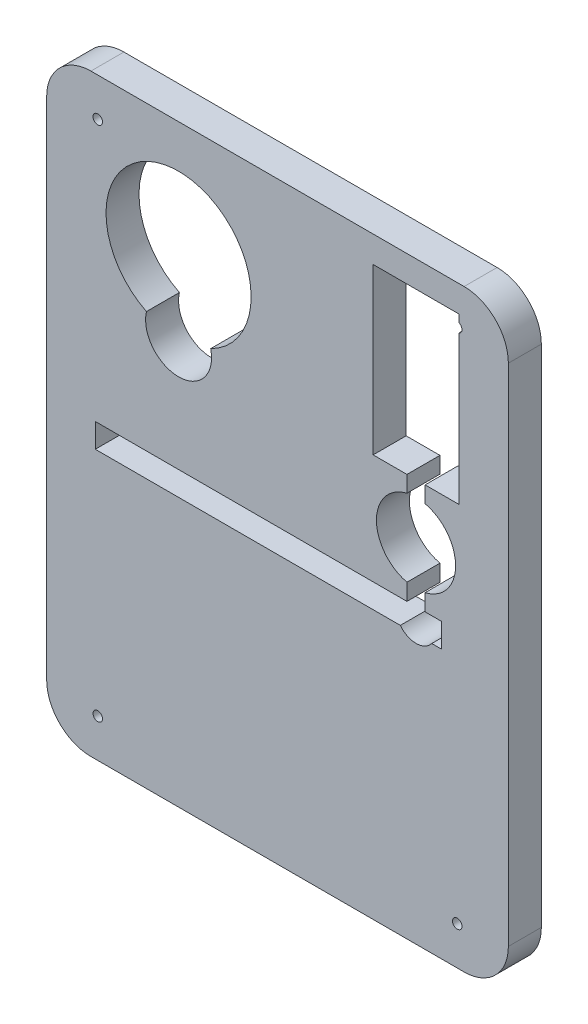
ISO-10303-21;
HEADER;
FILE_DESCRIPTION(('STEP AP214'),'2;1');
FILE_NAME('part.step','',(''),(''),'','','');
FILE_SCHEMA(('AUTOMOTIVE_DESIGN { 1 0 10303 214 1 1 1 1 }'));
ENDSEC;
DATA;
#1=APPLICATION_CONTEXT('core data for automotive mechanical design processes');
#2=APPLICATION_PROTOCOL_DEFINITION('international standard','automotive_design',2000,#1);
#3=PRODUCT_CONTEXT('',#1,'mechanical');
#4=PRODUCT('Part','Part','',(#3));
#5=PRODUCT_RELATED_PRODUCT_CATEGORY('part','',(#4));
#6=PRODUCT_DEFINITION_FORMATION('','',#4);
#7=PRODUCT_DEFINITION_CONTEXT('part definition',#1,'design');
#8=PRODUCT_DEFINITION('design','',#6,#7);
#9=PRODUCT_DEFINITION_SHAPE('','',#8);
#10=(LENGTH_UNIT() NAMED_UNIT(*) SI_UNIT(.MILLI.,.METRE.));
#11=(NAMED_UNIT(*) PLANE_ANGLE_UNIT() SI_UNIT($,.RADIAN.));
#12=(NAMED_UNIT(*) SI_UNIT($,.STERADIAN.) SOLID_ANGLE_UNIT());
#13=UNCERTAINTY_MEASURE_WITH_UNIT(LENGTH_MEASURE(1.E-05),#10,'distance_accuracy_value','');
#14=(GEOMETRIC_REPRESENTATION_CONTEXT(3) GLOBAL_UNCERTAINTY_ASSIGNED_CONTEXT((#13)) GLOBAL_UNIT_ASSIGNED_CONTEXT((#10,
#11,#12)) REPRESENTATION_CONTEXT('',''));
#15=CARTESIAN_POINT('',(0.,0.,0.));
#16=DIRECTION('',(0.,0.,1.));
#17=DIRECTION('',(1.,0.,0.));
#18=AXIS2_PLACEMENT_3D('',#15,#16,#17);
#19=CARTESIAN_POINT('',(69.85,104.14,0.));
#20=DIRECTION('',(1.,0.,0.));
#21=DIRECTION('',(0.,1.,0.));
#22=AXIS2_PLACEMENT_3D('',#19,#20,#21);
#23=PLANE('',#22);
#24=DIRECTION('',(0.,1.,0.));
#25=VECTOR('',#24,1.);
#26=CARTESIAN_POINT('',(69.85,104.14,0.));
#27=LINE('',#26,#25);
#28=CARTESIAN_POINT('',(69.85,101.22515584807,0.));
#29=VERTEX_POINT('',#28);
#30=CARTESIAN_POINT('',(69.85,104.14,0.));
#31=VERTEX_POINT('',#30);
#32=EDGE_CURVE('E246',#29,#31,#27,.T.);
#33=ORIENTED_EDGE('',*,*,#32,.F.);
#34=DIRECTION('',(0.,0.,1.));
#35=VECTOR('',#34,1.);
#36=CARTESIAN_POINT('',(69.85,101.22515584807,12.7));
#37=LINE('',#36,#35);
#38=CARTESIAN_POINT('',(69.85,101.22515584807,12.7));
#39=VERTEX_POINT('',#38);
#40=EDGE_CURVE('E11',#29,#39,#37,.T.);
#41=ORIENTED_EDGE('',*,*,#40,.T.);
#42=DIRECTION('',(0.,1.,0.));
#43=VECTOR('',#42,1.);
#44=CARTESIAN_POINT('',(69.85,104.14,12.7));
#45=LINE('',#44,#43);
#46=CARTESIAN_POINT('',(69.85,104.14,12.7));
#47=VERTEX_POINT('',#46);
#48=EDGE_CURVE('E312',#39,#47,#45,.T.);
#49=ORIENTED_EDGE('',*,*,#48,.T.);
#50=DIRECTION('',(0.,0.,1.));
#51=VECTOR('',#50,1.);
#52=CARTESIAN_POINT('',(69.85,104.14,0.));
#53=LINE('',#52,#51);
#54=EDGE_CURVE('E254',#31,#47,#53,.T.);
#55=ORIENTED_EDGE('',*,*,#54,.F.);
#56=EDGE_LOOP('',(#33,#41,#49,#55));
#57=FACE_BOUND('',#56,.T.);
#58=ADVANCED_FACE('F41',(#57),#23,.F.);
#59=CARTESIAN_POINT('',(-71.8566,-97.2566,12.7));
#60=DIRECTION('',(0.,0.,-1.));
#61=DIRECTION('',(-1.,0.,0.));
#62=AXIS2_PLACEMENT_3D('',#59,#60,#61);
#63=CYLINDRICAL_SURFACE('',#62,17.0434);
#64=CARTESIAN_POINT('',(-71.8566,-97.2566,0.));
#65=DIRECTION('',(0.,0.,1.));
#66=DIRECTION('',(-1.,0.,0.));
#67=AXIS2_PLACEMENT_3D('',#64,#65,#66);
#68=CIRCLE('',#67,17.0434);
#69=CARTESIAN_POINT('',(-88.9,-97.2566,0.));
#70=VERTEX_POINT('',#69);
#71=CARTESIAN_POINT('',(-71.8566,-114.3,0.));
#72=VERTEX_POINT('',#71);
#73=EDGE_CURVE('E322',#70,#72,#68,.T.);
#74=ORIENTED_EDGE('',*,*,#73,.T.);
#75=DIRECTION('',(0.,0.,-1.));
#76=VECTOR('',#75,1.);
#77=CARTESIAN_POINT('',(-71.8566,-114.3,12.7));
#78=LINE('',#77,#76);
#79=CARTESIAN_POINT('',(-71.8566,-114.3,12.7));
#80=VERTEX_POINT('',#79);
#81=EDGE_CURVE('E410',#80,#72,#78,.T.);
#82=ORIENTED_EDGE('',*,*,#81,.F.);
#83=CARTESIAN_POINT('',(-71.8566,-97.2566,12.7));
#84=DIRECTION('',(0.,0.,1.));
#85=DIRECTION('',(-1.,0.,0.));
#86=AXIS2_PLACEMENT_3D('',#83,#84,#85);
#87=CIRCLE('',#86,17.0434);
#88=CARTESIAN_POINT('',(-88.9,-97.2566,12.7));
#89=VERTEX_POINT('',#88);
#90=EDGE_CURVE('E356',#89,#80,#87,.T.);
#91=ORIENTED_EDGE('',*,*,#90,.F.);
#92=DIRECTION('',(0.,0.,-1.));
#93=VECTOR('',#92,1.);
#94=CARTESIAN_POINT('',(-88.9,-97.2566,12.7));
#95=LINE('',#94,#93);
#96=EDGE_CURVE('E374',#89,#70,#95,.T.);
#97=ORIENTED_EDGE('',*,*,#96,.T.);
#98=EDGE_LOOP('',(#74,#82,#91,#97));
#99=FACE_BOUND('',#98,.T.);
#100=ADVANCED_FACE('F43',(#99),#63,.T.);
#101=CARTESIAN_POINT('',(71.8566,-114.3,12.7));
#102=DIRECTION('',(0.,1.,0.));
#103=DIRECTION('',(0.,0.,1.));
#104=AXIS2_PLACEMENT_3D('',#101,#102,#103);
#105=PLANE('',#104);
#106=DIRECTION('',(1.,0.,0.));
#107=VECTOR('',#106,1.);
#108=CARTESIAN_POINT('',(71.8566,-114.3,0.));
#109=LINE('',#108,#107);
#110=CARTESIAN_POINT('',(71.8566,-114.3,0.));
#111=VERTEX_POINT('',#110);
#112=EDGE_CURVE('E377',#72,#111,#109,.T.);
#113=ORIENTED_EDGE('',*,*,#112,.T.);
#114=DIRECTION('',(0.,0.,-1.));
#115=VECTOR('',#114,1.);
#116=CARTESIAN_POINT('',(71.8566,-114.3,12.7));
#117=LINE('',#116,#115);
#118=CARTESIAN_POINT('',(71.8566,-114.3,12.7));
#119=VERTEX_POINT('',#118);
#120=EDGE_CURVE('E407',#119,#111,#117,.T.);
#121=ORIENTED_EDGE('',*,*,#120,.F.);
#122=DIRECTION('',(1.,0.,0.));
#123=VECTOR('',#122,1.);
#124=CARTESIAN_POINT('',(71.8566,-114.3,12.7));
#125=LINE('',#124,#123);
#126=EDGE_CURVE('E359',#80,#119,#125,.T.);
#127=ORIENTED_EDGE('',*,*,#126,.F.);
#128=ORIENTED_EDGE('',*,*,#81,.T.);
#129=EDGE_LOOP('',(#113,#121,#127,#128));
#130=FACE_BOUND('',#129,.T.);
#131=ADVANCED_FACE('F568',(#130),#105,.F.);
#132=CARTESIAN_POINT('',(71.8566,-97.2566,12.7));
#133=DIRECTION('',(0.,0.,-1.));
#134=DIRECTION('',(-1.,0.,0.));
#135=AXIS2_PLACEMENT_3D('',#132,#133,#134);
#136=CYLINDRICAL_SURFACE('',#135,17.0434);
#137=CARTESIAN_POINT('',(71.8566,-97.2566,0.));
#138=DIRECTION('',(0.,0.,1.));
#139=DIRECTION('',(-1.,0.,0.));
#140=AXIS2_PLACEMENT_3D('',#137,#138,#139);
#141=CIRCLE('',#140,17.0434);
#142=CARTESIAN_POINT('',(88.9,-97.2566,0.));
#143=VERTEX_POINT('',#142);
#144=EDGE_CURVE('E379',#111,#143,#141,.T.);
#145=ORIENTED_EDGE('',*,*,#144,.T.);
#146=DIRECTION('',(0.,0.,-1.));
#147=VECTOR('',#146,1.);
#148=CARTESIAN_POINT('',(88.9,-97.2566,12.7));
#149=LINE('',#148,#147);
#150=CARTESIAN_POINT('',(88.9,-97.2566,12.7));
#151=VERTEX_POINT('',#150);
#152=EDGE_CURVE('E404',#151,#143,#149,.T.);
#153=ORIENTED_EDGE('',*,*,#152,.F.);
#154=CARTESIAN_POINT('',(71.8566,-97.2566,12.7));
#155=DIRECTION('',(0.,0.,1.));
#156=DIRECTION('',(-1.,0.,0.));
#157=AXIS2_PLACEMENT_3D('',#154,#155,#156);
#158=CIRCLE('',#157,17.0434);
#159=EDGE_CURVE('E362',#119,#151,#158,.T.);
#160=ORIENTED_EDGE('',*,*,#159,.F.);
#161=ORIENTED_EDGE('',*,*,#120,.T.);
#162=EDGE_LOOP('',(#145,#153,#160,#161));
#163=FACE_BOUND('',#162,.T.);
#164=ADVANCED_FACE('F625',(#163),#136,.T.);
#165=CARTESIAN_POINT('',(88.9,-97.2566,12.7));
#166=DIRECTION('',(-1.,0.,0.));
#167=DIRECTION('',(0.,0.,1.));
#168=AXIS2_PLACEMENT_3D('',#165,#166,#167);
#169=PLANE('',#168);
#170=DIRECTION('',(0.,1.,0.));
#171=VECTOR('',#170,1.);
#172=CARTESIAN_POINT('',(88.9,-97.2566,0.));
#173=LINE('',#172,#171);
#174=CARTESIAN_POINT('',(88.9,97.2566,0.));
#175=VERTEX_POINT('',#174);
#176=EDGE_CURVE('E381',#143,#175,#173,.T.);
#177=ORIENTED_EDGE('',*,*,#176,.T.);
#178=DIRECTION('',(0.,0.,-1.));
#179=VECTOR('',#178,1.);
#180=CARTESIAN_POINT('',(88.9,97.2566,12.7));
#181=LINE('',#180,#179);
#182=CARTESIAN_POINT('',(88.9,97.2566,12.7));
#183=VERTEX_POINT('',#182);
#184=EDGE_CURVE('E401',#183,#175,#181,.T.);
#185=ORIENTED_EDGE('',*,*,#184,.F.);
#186=DIRECTION('',(0.,1.,0.));
#187=VECTOR('',#186,1.);
#188=CARTESIAN_POINT('',(88.9,-97.2566,12.7));
#189=LINE('',#188,#187);
#190=EDGE_CURVE('E364',#151,#183,#189,.T.);
#191=ORIENTED_EDGE('',*,*,#190,.F.);
#192=ORIENTED_EDGE('',*,*,#152,.T.);
#193=EDGE_LOOP('',(#177,#185,#191,#192));
#194=FACE_BOUND('',#193,.T.);
#195=ADVANCED_FACE('F621',(#194),#169,.F.);
#196=CARTESIAN_POINT('',(71.8566,97.2566,12.7));
#197=DIRECTION('',(0.,0.,-1.));
#198=DIRECTION('',(-1.,0.,0.));
#199=AXIS2_PLACEMENT_3D('',#196,#197,#198);
#200=CYLINDRICAL_SURFACE('',#199,17.0434);
#201=CARTESIAN_POINT('',(71.8566,97.2566,0.));
#202=DIRECTION('',(0.,0.,1.));
#203=DIRECTION('',(1.,0.,0.));
#204=AXIS2_PLACEMENT_3D('',#201,#202,#203);
#205=CIRCLE('',#204,17.0434);
#206=CARTESIAN_POINT('',(71.8566,114.3,0.));
#207=VERTEX_POINT('',#206);
#208=EDGE_CURVE('E383',#175,#207,#205,.T.);
#209=ORIENTED_EDGE('',*,*,#208,.T.);
#210=DIRECTION('',(0.,0.,-1.));
#211=VECTOR('',#210,1.);
#212=CARTESIAN_POINT('',(71.8566,114.3,12.7));
#213=LINE('',#212,#211);
#214=CARTESIAN_POINT('',(71.8566,114.3,12.7));
#215=VERTEX_POINT('',#214);
#216=EDGE_CURVE('E398',#215,#207,#213,.T.);
#217=ORIENTED_EDGE('',*,*,#216,.F.);
#218=CARTESIAN_POINT('',(71.8566,97.2566,12.7));
#219=DIRECTION('',(0.,0.,1.));
#220=DIRECTION('',(1.,0.,0.));
#221=AXIS2_PLACEMENT_3D('',#218,#219,#220);
#222=CIRCLE('',#221,17.0434);
#223=EDGE_CURVE('E366',#183,#215,#222,.T.);
#224=ORIENTED_EDGE('',*,*,#223,.F.);
#225=ORIENTED_EDGE('',*,*,#184,.T.);
#226=EDGE_LOOP('',(#209,#217,#224,#225));
#227=FACE_BOUND('',#226,.T.);
#228=ADVANCED_FACE('F617',(#227),#200,.T.);
#229=CARTESIAN_POINT('',(71.8566,114.3,12.7));
#230=DIRECTION('',(0.,-1.,0.));
#231=DIRECTION('',(0.,0.,-1.));
#232=AXIS2_PLACEMENT_3D('',#229,#230,#231);
#233=PLANE('',#232);
#234=DIRECTION('',(-1.,0.,0.));
#235=VECTOR('',#234,1.);
#236=CARTESIAN_POINT('',(71.8566,114.3,0.));
#237=LINE('',#236,#235);
#238=CARTESIAN_POINT('',(-71.8566,114.3,0.));
#239=VERTEX_POINT('',#238);
#240=EDGE_CURVE('E385',#207,#239,#237,.T.);
#241=ORIENTED_EDGE('',*,*,#240,.T.);
#242=DIRECTION('',(0.,0.,-1.));
#243=VECTOR('',#242,1.);
#244=CARTESIAN_POINT('',(-71.8566,114.3,12.7));
#245=LINE('',#244,#243);
#246=CARTESIAN_POINT('',(-71.8566,114.3,12.7));
#247=VERTEX_POINT('',#246);
#248=EDGE_CURVE('E395',#247,#239,#245,.T.);
#249=ORIENTED_EDGE('',*,*,#248,.F.);
#250=DIRECTION('',(-1.,0.,0.));
#251=VECTOR('',#250,1.);
#252=CARTESIAN_POINT('',(71.8566,114.3,12.7));
#253=LINE('',#252,#251);
#254=EDGE_CURVE('E368',#215,#247,#253,.T.);
#255=ORIENTED_EDGE('',*,*,#254,.F.);
#256=ORIENTED_EDGE('',*,*,#216,.T.);
#257=EDGE_LOOP('',(#241,#249,#255,#256));
#258=FACE_BOUND('',#257,.T.);
#259=ADVANCED_FACE('F613',(#258),#233,.F.);
#260=CARTESIAN_POINT('',(-71.8566,97.2566,12.7));
#261=DIRECTION('',(0.,0.,-1.));
#262=DIRECTION('',(-1.,0.,0.));
#263=AXIS2_PLACEMENT_3D('',#260,#261,#262);
#264=CYLINDRICAL_SURFACE('',#263,17.0434);
#265=CARTESIAN_POINT('',(-71.8566,97.2566,0.));
#266=DIRECTION('',(0.,0.,1.));
#267=DIRECTION('',(-1.,0.,0.));
#268=AXIS2_PLACEMENT_3D('',#265,#266,#267);
#269=CIRCLE('',#268,17.0434);
#270=CARTESIAN_POINT('',(-88.9,97.2566,0.));
#271=VERTEX_POINT('',#270);
#272=EDGE_CURVE('E387',#239,#271,#269,.T.);
#273=ORIENTED_EDGE('',*,*,#272,.T.);
#274=DIRECTION('',(0.,0.,-1.));
#275=VECTOR('',#274,1.);
#276=CARTESIAN_POINT('',(-88.9,97.2566,12.7));
#277=LINE('',#276,#275);
#278=CARTESIAN_POINT('',(-88.9,97.2566,12.7));
#279=VERTEX_POINT('',#278);
#280=EDGE_CURVE('E392',#279,#271,#277,.T.);
#281=ORIENTED_EDGE('',*,*,#280,.F.);
#282=CARTESIAN_POINT('',(-71.8566,97.2566,12.7));
#283=DIRECTION('',(0.,0.,1.));
#284=DIRECTION('',(-1.,0.,0.));
#285=AXIS2_PLACEMENT_3D('',#282,#283,#284);
#286=CIRCLE('',#285,17.0434);
#287=EDGE_CURVE('E370',#247,#279,#286,.T.);
#288=ORIENTED_EDGE('',*,*,#287,.F.);
#289=ORIENTED_EDGE('',*,*,#248,.T.);
#290=EDGE_LOOP('',(#273,#281,#288,#289));
#291=FACE_BOUND('',#290,.T.);
#292=ADVANCED_FACE('F609',(#291),#264,.T.);
#293=CARTESIAN_POINT('',(-88.9,-97.2566,12.7));
#294=DIRECTION('',(1.,0.,0.));
#295=DIRECTION('',(0.,0.,-1.));
#296=AXIS2_PLACEMENT_3D('',#293,#294,#295);
#297=PLANE('',#296);
#298=DIRECTION('',(0.,-1.,0.));
#299=VECTOR('',#298,1.);
#300=CARTESIAN_POINT('',(-88.9,-97.2566,0.));
#301=LINE('',#300,#299);
#302=EDGE_CURVE('E360',#271,#70,#301,.T.);
#303=ORIENTED_EDGE('',*,*,#302,.T.);
#304=ORIENTED_EDGE('',*,*,#96,.F.);
#305=DIRECTION('',(0.,-1.,0.));
#306=VECTOR('',#305,1.);
#307=CARTESIAN_POINT('',(-88.9,-97.2566,12.7));
#308=LINE('',#307,#306);
#309=EDGE_CURVE('E372',#279,#89,#308,.T.);
#310=ORIENTED_EDGE('',*,*,#309,.F.);
#311=ORIENTED_EDGE('',*,*,#280,.T.);
#312=EDGE_LOOP('',(#303,#304,#310,#311));
#313=FACE_BOUND('',#312,.T.);
#314=ADVANCED_FACE('F602',(#313),#297,.F.);
#315=CARTESIAN_POINT('',(-71.8566,-97.2566,12.7));
#316=DIRECTION('',(0.,0.,-1.));
#317=DIRECTION('',(-1.,0.,0.));
#318=AXIS2_PLACEMENT_3D('',#315,#316,#317);
#319=PLANE('',#318);
#320=CARTESIAN_POINT('',(-69.21913,-99.508615,12.7));
#321=DIRECTION('',(0.,0.,1.));
#322=DIRECTION('',(1.,0.,0.));
#323=AXIS2_PLACEMENT_3D('',#320,#321,#322);
#324=CIRCLE('',#323,1.82879999999999);
#325=CARTESIAN_POINT('',(-67.39033,-99.508615,12.7));
#326=VERTEX_POINT('',#325);
#327=EDGE_CURVE('E866',#326,#326,#324,.T.);
#328=ORIENTED_EDGE('',*,*,#327,.F.);
#329=EDGE_LOOP('',(#328));
#330=FACE_BOUND('',#329,.T.);
#331=CARTESIAN_POINT('',(69.219129999995,-99.5086149999996,12.7));
#332=DIRECTION('',(0.,0.,1.));
#333=DIRECTION('',(1.,0.,0.));
#334=AXIS2_PLACEMENT_3D('',#331,#332,#333);
#335=CIRCLE('',#334,1.82879999999999);
#336=CARTESIAN_POINT('',(71.047929999995,-99.5086149999996,12.7));
#337=VERTEX_POINT('',#336);
#338=EDGE_CURVE('E423',#337,#337,#335,.T.);
#339=ORIENTED_EDGE('',*,*,#338,.F.);
#340=EDGE_LOOP('',(#339));
#341=FACE_BOUND('',#340,.T.);
#342=CARTESIAN_POINT('',(-69.219129999995,99.5086149999996,12.7));
#343=DIRECTION('',(0.,0.,1.));
#344=DIRECTION('',(1.,0.,0.));
#345=AXIS2_PLACEMENT_3D('',#342,#343,#344);
#346=CIRCLE('',#345,1.82879999999999);
#347=CARTESIAN_POINT('',(-67.390329999995,99.5086149999996,12.7));
#348=VERTEX_POINT('',#347);
#349=EDGE_CURVE('E251',#348,#348,#346,.T.);
#350=ORIENTED_EDGE('',*,*,#349,.F.);
#351=EDGE_LOOP('',(#350));
#352=FACE_BOUND('',#351,.T.);
#353=CARTESIAN_POINT('',(-38.1,69.85,12.7));
#354=DIRECTION('',(0.,0.,1.));
#355=DIRECTION('',(1.,0.,0.));
#356=AXIS2_PLACEMENT_3D('',#353,#354,#355);
#357=CIRCLE('',#356,27.94);
#358=CARTESIAN_POINT('',(-25.7323444032962,44.7963636363636,12.7));
#359=VERTEX_POINT('',#358);
#360=CARTESIAN_POINT('',(-50.4676555967038,44.7963636363636,12.7));
#361=VERTEX_POINT('',#360);
#362=EDGE_CURVE('E437',#359,#361,#357,.T.);
#363=ORIENTED_EDGE('',*,*,#362,.F.);
#364=CARTESIAN_POINT('',(-38.1,41.91,12.7));
#365=DIRECTION('',(0.,0.,1.));
#366=DIRECTION('',(1.,0.,0.));
#367=AXIS2_PLACEMENT_3D('',#364,#365,#366);
#368=CIRCLE('',#367,12.7);
#369=EDGE_CURVE('E64',#361,#359,#368,.T.);
#370=ORIENTED_EDGE('',*,*,#369,.F.);
#371=EDGE_LOOP('',(#363,#370));
#372=FACE_BOUND('',#371,.T.);
#373=ORIENTED_EDGE('',*,*,#48,.F.);
#374=CARTESIAN_POINT('',(69.219129999995,99.5086149999996,12.7));
#375=DIRECTION('',(0.,0.,1.));
#376=DIRECTION('',(1.,0.,0.));
#377=AXIS2_PLACEMENT_3D('',#374,#375,#376);
#378=CIRCLE('',#377,1.82879999999999);
#379=CARTESIAN_POINT('',(69.85,97.7920741519294,12.7));
#380=VERTEX_POINT('',#379);
#381=EDGE_CURVE('E237',#380,#39,#378,.T.);
#382=ORIENTED_EDGE('',*,*,#381,.F.);
#383=CARTESIAN_POINT('',(69.85,40.64,12.7));
#384=VERTEX_POINT('',#383);
#385=EDGE_CURVE('E313',#384,#380,#45,.T.);
#386=ORIENTED_EDGE('',*,*,#385,.F.);
#387=DIRECTION('',(1.,0.,0.));
#388=VECTOR('',#387,1.);
#389=CARTESIAN_POINT('',(56.8325,40.64,12.7));
#390=LINE('',#389,#388);
#391=CARTESIAN_POINT('',(56.8325,40.64,12.7));
#392=VERTEX_POINT('',#391);
#393=EDGE_CURVE('E309',#392,#384,#390,.T.);
#394=ORIENTED_EDGE('',*,*,#393,.F.);
#395=DIRECTION('',(0.,1.,0.));
#396=VECTOR('',#395,1.);
#397=CARTESIAN_POINT('',(56.8325,40.64,12.7));
#398=LINE('',#397,#396);
#399=CARTESIAN_POINT('',(56.8325,34.360670910504,12.7));
#400=VERTEX_POINT('',#399);
#401=EDGE_CURVE('E306',#400,#392,#398,.T.);
#402=ORIENTED_EDGE('',*,*,#401,.F.);
#403=CARTESIAN_POINT('',(53.34,19.52625,12.7));
#404=DIRECTION('',(0.,0.,1.));
#405=DIRECTION('',(1.,0.,0.));
#406=AXIS2_PLACEMENT_3D('',#403,#404,#405);
#407=CIRCLE('',#406,15.24);
#408=CARTESIAN_POINT('',(56.8325,4.69182908949591,12.7));
#409=VERTEX_POINT('',#408);
#410=EDGE_CURVE('E303',#409,#400,#407,.T.);
#411=ORIENTED_EDGE('',*,*,#410,.F.);
#412=DIRECTION('',(0.,1.,0.));
#413=VECTOR('',#412,1.);
#414=CARTESIAN_POINT('',(56.8325,4.69182908949591,12.7));
#415=LINE('',#414,#413);
#416=CARTESIAN_POINT('',(56.8325,-1.71450000000005,12.7));
#417=VERTEX_POINT('',#416);
#418=EDGE_CURVE('E300',#417,#409,#415,.T.);
#419=ORIENTED_EDGE('',*,*,#418,.F.);
#420=DIRECTION('',(-1.,0.,0.));
#421=VECTOR('',#420,1.);
#422=CARTESIAN_POINT('',(56.8325,-1.71450000000005,12.7));
#423=LINE('',#422,#421);
#424=CARTESIAN_POINT('',(63.1825,-1.71450000000005,12.7));
#425=VERTEX_POINT('',#424);
#426=EDGE_CURVE('E297',#425,#417,#423,.T.);
#427=ORIENTED_EDGE('',*,*,#426,.F.);
#428=DIRECTION('',(0.,1.,0.));
#429=VECTOR('',#428,1.);
#430=CARTESIAN_POINT('',(63.1825,-1.71450000000005,12.7));
#431=LINE('',#430,#429);
#432=CARTESIAN_POINT('',(63.1825,-10.9855,12.7));
#433=VERTEX_POINT('',#432);
#434=EDGE_CURVE('E294',#433,#425,#431,.T.);
#435=ORIENTED_EDGE('',*,*,#434,.F.);
#436=DIRECTION('',(1.,0.,0.));
#437=VECTOR('',#436,1.);
#438=CARTESIAN_POINT('',(63.1825,-10.9855,12.7));
#439=LINE('',#438,#437);
#440=CARTESIAN_POINT('',(59.3878541442399,-10.9855,12.7));
#441=VERTEX_POINT('',#440);
#442=EDGE_CURVE('E291',#441,#433,#439,.T.);
#443=ORIENTED_EDGE('',*,*,#442,.F.);
#444=CARTESIAN_POINT('',(53.34,-6.35000000000004,12.7));
#445=DIRECTION('',(0.,0.,1.));
#446=DIRECTION('',(1.,0.,0.));
#447=AXIS2_PLACEMENT_3D('',#444,#445,#446);
#448=CIRCLE('',#447,7.62);
#449=CARTESIAN_POINT('',(47.2921458557601,-10.9855,12.7));
#450=VERTEX_POINT('',#449);
#451=EDGE_CURVE('E288',#450,#441,#448,.T.);
#452=ORIENTED_EDGE('',*,*,#451,.F.);
#453=DIRECTION('',(1.,0.,0.));
#454=VECTOR('',#453,1.);
#455=CARTESIAN_POINT('',(47.2921458557601,-10.9855,12.7));
#456=LINE('',#455,#454);
#457=CARTESIAN_POINT('',(-70.1674999999999,-10.9855000000001,12.7));
#458=VERTEX_POINT('',#457);
#459=EDGE_CURVE('E285',#458,#450,#456,.T.);
#460=ORIENTED_EDGE('',*,*,#459,.F.);
#461=DIRECTION('',(0.,-1.,0.));
#462=VECTOR('',#461,1.);
#463=CARTESIAN_POINT('',(-70.1674999999999,-10.9855000000001,12.7));
#464=LINE('',#463,#462);
#465=CARTESIAN_POINT('',(-70.1674999999999,-1.71450000000005,12.7));
#466=VERTEX_POINT('',#465);
#467=EDGE_CURVE('E282',#466,#458,#464,.T.);
#468=ORIENTED_EDGE('',*,*,#467,.F.);
#469=DIRECTION('',(-1.,0.,0.));
#470=VECTOR('',#469,1.);
#471=CARTESIAN_POINT('',(-70.1674999999999,-1.71450000000005,12.7));
#472=LINE('',#471,#470);
#473=CARTESIAN_POINT('',(49.8475,-1.71450000000005,12.7));
#474=VERTEX_POINT('',#473);
#475=EDGE_CURVE('E279',#474,#466,#472,.T.);
#476=ORIENTED_EDGE('',*,*,#475,.F.);
#477=DIRECTION('',(0.,-1.,0.));
#478=VECTOR('',#477,1.);
#479=CARTESIAN_POINT('',(49.8475,4.69182908949591,12.7));
#480=LINE('',#479,#478);
#481=CARTESIAN_POINT('',(49.8475,4.69182908949591,12.7));
#482=VERTEX_POINT('',#481);
#483=EDGE_CURVE('E276',#482,#474,#480,.T.);
#484=ORIENTED_EDGE('',*,*,#483,.F.);
#485=CARTESIAN_POINT('',(53.34,19.52625,12.7));
#486=DIRECTION('',(0.,0.,1.));
#487=DIRECTION('',(1.,0.,0.));
#488=AXIS2_PLACEMENT_3D('',#485,#486,#487);
#489=CIRCLE('',#488,15.24);
#490=CARTESIAN_POINT('',(49.8475,34.360670910504,12.7));
#491=VERTEX_POINT('',#490);
#492=EDGE_CURVE('E273',#491,#482,#489,.T.);
#493=ORIENTED_EDGE('',*,*,#492,.F.);
#494=DIRECTION('',(0.,-1.,0.));
#495=VECTOR('',#494,1.);
#496=CARTESIAN_POINT('',(49.8475,40.64,12.7));
#497=LINE('',#496,#495);
#498=CARTESIAN_POINT('',(49.8475,40.64,12.7));
#499=VERTEX_POINT('',#498);
#500=EDGE_CURVE('E270',#499,#491,#497,.T.);
#501=ORIENTED_EDGE('',*,*,#500,.F.);
#502=DIRECTION('',(1.,0.,0.));
#503=VECTOR('',#502,1.);
#504=CARTESIAN_POINT('',(36.83,40.64,12.7));
#505=LINE('',#504,#503);
#506=CARTESIAN_POINT('',(36.83,40.64,12.7));
#507=VERTEX_POINT('',#506);
#508=EDGE_CURVE('E267',#507,#499,#505,.T.);
#509=ORIENTED_EDGE('',*,*,#508,.F.);
#510=DIRECTION('',(0.,-1.,0.));
#511=VECTOR('',#510,1.);
#512=CARTESIAN_POINT('',(36.83,104.14,12.7));
#513=LINE('',#512,#511);
#514=CARTESIAN_POINT('',(36.83,104.14,12.7));
#515=VERTEX_POINT('',#514);
#516=EDGE_CURVE('E265',#515,#507,#513,.T.);
#517=ORIENTED_EDGE('',*,*,#516,.F.);
#518=DIRECTION('',(-1.,0.,0.));
#519=VECTOR('',#518,1.);
#520=CARTESIAN_POINT('',(36.83,104.14,12.7));
#521=LINE('',#520,#519);
#522=EDGE_CURVE('E316',#47,#515,#521,.T.);
#523=ORIENTED_EDGE('',*,*,#522,.F.);
#524=EDGE_LOOP('',(#373,#382,#386,#394,#402,#411,#419,#427,#435,#443,#452,#460,#468,#476,#484,
#493,#501,#509,#517,#523));
#525=FACE_BOUND('',#524,.T.);
#526=ORIENTED_EDGE('',*,*,#90,.T.);
#527=ORIENTED_EDGE('',*,*,#126,.T.);
#528=ORIENTED_EDGE('',*,*,#159,.T.);
#529=ORIENTED_EDGE('',*,*,#190,.T.);
#530=ORIENTED_EDGE('',*,*,#223,.T.);
#531=ORIENTED_EDGE('',*,*,#254,.T.);
#532=ORIENTED_EDGE('',*,*,#287,.T.);
#533=ORIENTED_EDGE('',*,*,#309,.T.);
#534=EDGE_LOOP('',(#526,#527,#528,#529,#530,#531,#532,#533));
#535=FACE_BOUND('',#534,.T.);
#536=ADVANCED_FACE('F416',(#330,#341,#352,#372,#525,#535),#319,.F.);
#537=CARTESIAN_POINT('',(-71.8566,-97.2566,0.));
#538=DIRECTION('',(0.,0.,-1.));
#539=DIRECTION('',(-1.,0.,0.));
#540=AXIS2_PLACEMENT_3D('',#537,#538,#539);
#541=PLANE('',#540);
#542=CARTESIAN_POINT('',(-69.21913,-99.508615,0.));
#543=DIRECTION('',(0.,0.,1.));
#544=DIRECTION('',(1.,0.,0.));
#545=AXIS2_PLACEMENT_3D('',#542,#543,#544);
#546=CIRCLE('',#545,1.82879999999999);
#547=CARTESIAN_POINT('',(-67.39033,-99.508615,0.));
#548=VERTEX_POINT('',#547);
#549=EDGE_CURVE('E863',#548,#548,#546,.T.);
#550=ORIENTED_EDGE('',*,*,#549,.T.);
#551=EDGE_LOOP('',(#550));
#552=FACE_BOUND('',#551,.T.);
#553=CARTESIAN_POINT('',(69.219129999995,-99.5086149999996,0.));
#554=DIRECTION('',(0.,0.,1.));
#555=DIRECTION('',(1.,0.,0.));
#556=AXIS2_PLACEMENT_3D('',#553,#554,#555);
#557=CIRCLE('',#556,1.82879999999999);
#558=CARTESIAN_POINT('',(71.047929999995,-99.5086149999996,0.));
#559=VERTEX_POINT('',#558);
#560=EDGE_CURVE('E420',#559,#559,#557,.T.);
#561=ORIENTED_EDGE('',*,*,#560,.T.);
#562=EDGE_LOOP('',(#561));
#563=FACE_BOUND('',#562,.T.);
#564=CARTESIAN_POINT('',(69.219129999995,99.5086149999996,0.));
#565=DIRECTION('',(0.,0.,1.));
#566=DIRECTION('',(1.,0.,0.));
#567=AXIS2_PLACEMENT_3D('',#564,#565,#566);
#568=CIRCLE('',#567,1.82879999999999);
#569=CARTESIAN_POINT('',(69.85,97.7920741519294,0.));
#570=VERTEX_POINT('',#569);
#571=EDGE_CURVE('E56',#570,#29,#568,.T.);
#572=ORIENTED_EDGE('',*,*,#571,.T.);
#573=ORIENTED_EDGE('',*,*,#32,.T.);
#574=DIRECTION('',(-1.,0.,0.));
#575=VECTOR('',#574,1.);
#576=CARTESIAN_POINT('',(36.83,104.14,0.));
#577=LINE('',#576,#575);
#578=CARTESIAN_POINT('',(36.83,104.14,0.));
#579=VERTEX_POINT('',#578);
#580=EDGE_CURVE('E258',#31,#579,#577,.T.);
#581=ORIENTED_EDGE('',*,*,#580,.T.);
#582=DIRECTION('',(0.,-1.,0.));
#583=VECTOR('',#582,1.);
#584=CARTESIAN_POINT('',(36.83,104.14,0.));
#585=LINE('',#584,#583);
#586=CARTESIAN_POINT('',(36.83,40.64,0.));
#587=VERTEX_POINT('',#586);
#588=EDGE_CURVE('E319',#579,#587,#585,.T.);
#589=ORIENTED_EDGE('',*,*,#588,.T.);
#590=DIRECTION('',(1.,0.,0.));
#591=VECTOR('',#590,1.);
#592=CARTESIAN_POINT('',(36.83,40.64,0.));
#593=LINE('',#592,#591);
#594=CARTESIAN_POINT('',(49.8475,40.64,0.));
#595=VERTEX_POINT('',#594);
#596=EDGE_CURVE('E448',#587,#595,#593,.T.);
#597=ORIENTED_EDGE('',*,*,#596,.T.);
#598=DIRECTION('',(0.,-1.,0.));
#599=VECTOR('',#598,1.);
#600=CARTESIAN_POINT('',(49.8475,40.64,0.));
#601=LINE('',#600,#599);
#602=CARTESIAN_POINT('',(49.8475,34.360670910504,0.));
#603=VERTEX_POINT('',#602);
#604=EDGE_CURVE('E451',#595,#603,#601,.T.);
#605=ORIENTED_EDGE('',*,*,#604,.T.);
#606=CARTESIAN_POINT('',(53.34,19.52625,0.));
#607=DIRECTION('',(0.,0.,1.));
#608=DIRECTION('',(1.,0.,0.));
#609=AXIS2_PLACEMENT_3D('',#606,#607,#608);
#610=CIRCLE('',#609,15.24);
#611=CARTESIAN_POINT('',(49.8475,4.69182908949591,0.));
#612=VERTEX_POINT('',#611);
#613=EDGE_CURVE('E454',#603,#612,#610,.T.);
#614=ORIENTED_EDGE('',*,*,#613,.T.);
#615=DIRECTION('',(0.,-1.,0.));
#616=VECTOR('',#615,1.);
#617=CARTESIAN_POINT('',(49.8475,4.69182908949591,0.));
#618=LINE('',#617,#616);
#619=CARTESIAN_POINT('',(49.8475,-1.71450000000005,0.));
#620=VERTEX_POINT('',#619);
#621=EDGE_CURVE('E457',#612,#620,#618,.T.);
#622=ORIENTED_EDGE('',*,*,#621,.T.);
#623=DIRECTION('',(-1.,0.,0.));
#624=VECTOR('',#623,1.);
#625=CARTESIAN_POINT('',(-70.1674999999999,-1.71450000000005,0.));
#626=LINE('',#625,#624);
#627=CARTESIAN_POINT('',(-70.1674999999999,-1.71450000000005,0.));
#628=VERTEX_POINT('',#627);
#629=EDGE_CURVE('E460',#620,#628,#626,.T.);
#630=ORIENTED_EDGE('',*,*,#629,.T.);
#631=DIRECTION('',(0.,-1.,0.));
#632=VECTOR('',#631,1.);
#633=CARTESIAN_POINT('',(-70.1674999999999,-10.9855000000001,0.));
#634=LINE('',#633,#632);
#635=CARTESIAN_POINT('',(-70.1674999999999,-10.9855000000001,0.));
#636=VERTEX_POINT('',#635);
#637=EDGE_CURVE('E463',#628,#636,#634,.T.);
#638=ORIENTED_EDGE('',*,*,#637,.T.);
#639=DIRECTION('',(1.,0.,0.));
#640=VECTOR('',#639,1.);
#641=CARTESIAN_POINT('',(47.2921458557601,-10.9855,0.));
#642=LINE('',#641,#640);
#643=CARTESIAN_POINT('',(47.2921458557601,-10.9855,0.));
#644=VERTEX_POINT('',#643);
#645=EDGE_CURVE('E466',#636,#644,#642,.T.);
#646=ORIENTED_EDGE('',*,*,#645,.T.);
#647=CARTESIAN_POINT('',(53.34,-6.35000000000004,0.));
#648=DIRECTION('',(0.,0.,1.));
#649=DIRECTION('',(1.,0.,0.));
#650=AXIS2_PLACEMENT_3D('',#647,#648,#649);
#651=CIRCLE('',#650,7.62);
#652=CARTESIAN_POINT('',(59.3878541442399,-10.9855,0.));
#653=VERTEX_POINT('',#652);
#654=EDGE_CURVE('E469',#644,#653,#651,.T.);
#655=ORIENTED_EDGE('',*,*,#654,.T.);
#656=DIRECTION('',(1.,0.,0.));
#657=VECTOR('',#656,1.);
#658=CARTESIAN_POINT('',(63.1825,-10.9855,0.));
#659=LINE('',#658,#657);
#660=CARTESIAN_POINT('',(63.1825,-10.9855,0.));
#661=VERTEX_POINT('',#660);
#662=EDGE_CURVE('E472',#653,#661,#659,.T.);
#663=ORIENTED_EDGE('',*,*,#662,.T.);
#664=DIRECTION('',(0.,1.,0.));
#665=VECTOR('',#664,1.);
#666=CARTESIAN_POINT('',(63.1825,-1.71450000000005,0.));
#667=LINE('',#666,#665);
#668=CARTESIAN_POINT('',(63.1825,-1.71450000000005,0.));
#669=VERTEX_POINT('',#668);
#670=EDGE_CURVE('E475',#661,#669,#667,.T.);
#671=ORIENTED_EDGE('',*,*,#670,.T.);
#672=DIRECTION('',(-1.,0.,0.));
#673=VECTOR('',#672,1.);
#674=CARTESIAN_POINT('',(56.8325,-1.71450000000005,0.));
#675=LINE('',#674,#673);
#676=CARTESIAN_POINT('',(56.8325,-1.71450000000005,0.));
#677=VERTEX_POINT('',#676);
#678=EDGE_CURVE('E478',#669,#677,#675,.T.);
#679=ORIENTED_EDGE('',*,*,#678,.T.);
#680=DIRECTION('',(0.,1.,0.));
#681=VECTOR('',#680,1.);
#682=CARTESIAN_POINT('',(56.8325,4.69182908949591,0.));
#683=LINE('',#682,#681);
#684=CARTESIAN_POINT('',(56.8325,4.69182908949591,0.));
#685=VERTEX_POINT('',#684);
#686=EDGE_CURVE('E481',#677,#685,#683,.T.);
#687=ORIENTED_EDGE('',*,*,#686,.T.);
#688=CARTESIAN_POINT('',(53.34,19.52625,0.));
#689=DIRECTION('',(0.,0.,1.));
#690=DIRECTION('',(1.,0.,0.));
#691=AXIS2_PLACEMENT_3D('',#688,#689,#690);
#692=CIRCLE('',#691,15.24);
#693=CARTESIAN_POINT('',(56.8325,34.360670910504,0.));
#694=VERTEX_POINT('',#693);
#695=EDGE_CURVE('E484',#685,#694,#692,.T.);
#696=ORIENTED_EDGE('',*,*,#695,.T.);
#697=DIRECTION('',(0.,1.,0.));
#698=VECTOR('',#697,1.);
#699=CARTESIAN_POINT('',(56.8325,40.64,0.));
#700=LINE('',#699,#698);
#701=CARTESIAN_POINT('',(56.8325,40.64,0.));
#702=VERTEX_POINT('',#701);
#703=EDGE_CURVE('E259',#694,#702,#700,.T.);
#704=ORIENTED_EDGE('',*,*,#703,.T.);
#705=DIRECTION('',(1.,0.,0.));
#706=VECTOR('',#705,1.);
#707=CARTESIAN_POINT('',(56.8325,40.64,0.));
#708=LINE('',#707,#706);
#709=CARTESIAN_POINT('',(69.85,40.64,0.));
#710=VERTEX_POINT('',#709);
#711=EDGE_CURVE('E256',#702,#710,#708,.T.);
#712=ORIENTED_EDGE('',*,*,#711,.T.);
#713=EDGE_CURVE('E250',#710,#570,#27,.T.);
#714=ORIENTED_EDGE('',*,*,#713,.T.);
#715=EDGE_LOOP('',(#572,#573,#581,#589,#597,#605,#614,#622,#630,#638,#646,#655,#663,#671,#679,
#687,#696,#704,#712,#714));
#716=FACE_BOUND('',#715,.T.);
#717=CARTESIAN_POINT('',(-69.219129999995,99.5086149999996,0.));
#718=DIRECTION('',(0.,0.,1.));
#719=DIRECTION('',(1.,0.,0.));
#720=AXIS2_PLACEMENT_3D('',#717,#718,#719);
#721=CIRCLE('',#720,1.82879999999999);
#722=CARTESIAN_POINT('',(-67.390329999995,99.5086149999996,0.));
#723=VERTEX_POINT('',#722);
#724=EDGE_CURVE('E429',#723,#723,#721,.T.);
#725=ORIENTED_EDGE('',*,*,#724,.T.);
#726=EDGE_LOOP('',(#725));
#727=FACE_BOUND('',#726,.T.);
#728=CARTESIAN_POINT('',(-38.1,41.91,0.));
#729=DIRECTION('',(0.,0.,1.));
#730=DIRECTION('',(1.,0.,0.));
#731=AXIS2_PLACEMENT_3D('',#728,#729,#730);
#732=CIRCLE('',#731,12.7);
#733=CARTESIAN_POINT('',(-50.4676555967038,44.7963636363636,0.));
#734=VERTEX_POINT('',#733);
#735=CARTESIAN_POINT('',(-25.7323444032962,44.7963636363636,0.));
#736=VERTEX_POINT('',#735);
#737=EDGE_CURVE('E440',#734,#736,#732,.T.);
#738=ORIENTED_EDGE('',*,*,#737,.T.);
#739=CARTESIAN_POINT('',(-38.1,69.85,0.));
#740=DIRECTION('',(0.,0.,1.));
#741=DIRECTION('',(1.,0.,0.));
#742=AXIS2_PLACEMENT_3D('',#739,#740,#741);
#743=CIRCLE('',#742,27.94);
#744=EDGE_CURVE('E435',#736,#734,#743,.T.);
#745=ORIENTED_EDGE('',*,*,#744,.T.);
#746=EDGE_LOOP('',(#738,#745));
#747=FACE_BOUND('',#746,.T.);
#748=ORIENTED_EDGE('',*,*,#73,.F.);
#749=ORIENTED_EDGE('',*,*,#302,.F.);
#750=ORIENTED_EDGE('',*,*,#272,.F.);
#751=ORIENTED_EDGE('',*,*,#240,.F.);
#752=ORIENTED_EDGE('',*,*,#208,.F.);
#753=ORIENTED_EDGE('',*,*,#176,.F.);
#754=ORIENTED_EDGE('',*,*,#144,.F.);
#755=ORIENTED_EDGE('',*,*,#112,.F.);
#756=EDGE_LOOP('',(#748,#749,#750,#751,#752,#753,#754,#755));
#757=FACE_BOUND('',#756,.T.);
#758=ADVANCED_FACE('F243',(#552,#563,#716,#727,#747,#757),#541,.T.);
#759=CARTESIAN_POINT('',(36.83,104.14,0.));
#760=DIRECTION('',(-1.,0.,0.));
#761=DIRECTION('',(0.,-1.,0.));
#762=AXIS2_PLACEMENT_3D('',#759,#760,#761);
#763=PLANE('',#762);
#764=ORIENTED_EDGE('',*,*,#516,.T.);
#765=DIRECTION('',(0.,0.,1.));
#766=VECTOR('',#765,1.);
#767=CARTESIAN_POINT('',(36.83,40.64,0.));
#768=LINE('',#767,#766);
#769=EDGE_CURVE('E264',#587,#507,#768,.T.);
#770=ORIENTED_EDGE('',*,*,#769,.F.);
#771=ORIENTED_EDGE('',*,*,#588,.F.);
#772=DIRECTION('',(0.,0.,1.));
#773=VECTOR('',#772,1.);
#774=CARTESIAN_POINT('',(36.83,104.14,0.));
#775=LINE('',#774,#773);
#776=EDGE_CURVE('E320',#579,#515,#775,.T.);
#777=ORIENTED_EDGE('',*,*,#776,.T.);
#778=EDGE_LOOP('',(#764,#770,#771,#777));
#779=FACE_BOUND('',#778,.T.);
#780=ADVANCED_FACE('F549',(#779),#763,.F.);
#781=CARTESIAN_POINT('',(36.83,104.14,0.));
#782=DIRECTION('',(0.,1.,0.));
#783=DIRECTION('',(-1.,0.,0.));
#784=AXIS2_PLACEMENT_3D('',#781,#782,#783);
#785=PLANE('',#784);
#786=ORIENTED_EDGE('',*,*,#522,.T.);
#787=ORIENTED_EDGE('',*,*,#776,.F.);
#788=ORIENTED_EDGE('',*,*,#580,.F.);
#789=ORIENTED_EDGE('',*,*,#54,.T.);
#790=EDGE_LOOP('',(#786,#787,#788,#789));
#791=FACE_BOUND('',#790,.T.);
#792=ADVANCED_FACE('F551',(#791),#785,.F.);
#793=ORIENTED_EDGE('',*,*,#385,.T.);
#794=DIRECTION('',(0.,0.,1.));
#795=VECTOR('',#794,1.);
#796=CARTESIAN_POINT('',(69.85,97.7920741519294,12.7));
#797=LINE('',#796,#795);
#798=EDGE_CURVE('E49',#380,#570,#797,.F.);
#799=ORIENTED_EDGE('',*,*,#798,.T.);
#800=ORIENTED_EDGE('',*,*,#713,.F.);
#801=DIRECTION('',(0.,0.,1.));
#802=VECTOR('',#801,1.);
#803=CARTESIAN_POINT('',(69.85,40.64,0.));
#804=LINE('',#803,#802);
#805=EDGE_CURVE('E324',#710,#384,#804,.T.);
#806=ORIENTED_EDGE('',*,*,#805,.T.);
#807=EDGE_LOOP('',(#793,#799,#800,#806));
#808=FACE_BOUND('',#807,.T.);
#809=ADVANCED_FACE('F413',(#808),#23,.F.);
#810=CARTESIAN_POINT('',(56.8325,40.64,0.));
#811=DIRECTION('',(0.,-1.,0.));
#812=DIRECTION('',(0.,0.,-1.));
#813=AXIS2_PLACEMENT_3D('',#810,#811,#812);
#814=PLANE('',#813);
#815=ORIENTED_EDGE('',*,*,#393,.T.);
#816=ORIENTED_EDGE('',*,*,#805,.F.);
#817=ORIENTED_EDGE('',*,*,#711,.F.);
#818=DIRECTION('',(0.,0.,1.));
#819=VECTOR('',#818,1.);
#820=CARTESIAN_POINT('',(56.8325,40.64,0.));
#821=LINE('',#820,#819);
#822=EDGE_CURVE('E326',#702,#392,#821,.T.);
#823=ORIENTED_EDGE('',*,*,#822,.T.);
#824=EDGE_LOOP('',(#815,#816,#817,#823));
#825=FACE_BOUND('',#824,.T.);
#826=ADVANCED_FACE('F494',(#825),#814,.F.);
#827=CARTESIAN_POINT('',(56.8325,40.64,0.));
#828=DIRECTION('',(1.,0.,0.));
#829=DIRECTION('',(0.,0.,-1.));
#830=AXIS2_PLACEMENT_3D('',#827,#828,#829);
#831=PLANE('',#830);
#832=ORIENTED_EDGE('',*,*,#401,.T.);
#833=ORIENTED_EDGE('',*,*,#822,.F.);
#834=ORIENTED_EDGE('',*,*,#703,.F.);
#835=DIRECTION('',(0.,0.,1.));
#836=VECTOR('',#835,1.);
#837=CARTESIAN_POINT('',(56.8325,34.360670910504,0.));
#838=LINE('',#837,#836);
#839=EDGE_CURVE('E328',#694,#400,#838,.T.);
#840=ORIENTED_EDGE('',*,*,#839,.T.);
#841=EDGE_LOOP('',(#832,#833,#834,#840));
#842=FACE_BOUND('',#841,.T.);
#843=ADVANCED_FACE('F491',(#842),#831,.F.);
#844=CARTESIAN_POINT('',(53.34,19.52625,0.));
#845=DIRECTION('',(0.,0.,1.));
#846=DIRECTION('',(1.,0.,0.));
#847=AXIS2_PLACEMENT_3D('',#844,#845,#846);
#848=CYLINDRICAL_SURFACE('',#847,15.24);
#849=ORIENTED_EDGE('',*,*,#410,.T.);
#850=ORIENTED_EDGE('',*,*,#839,.F.);
#851=ORIENTED_EDGE('',*,*,#695,.F.);
#852=DIRECTION('',(0.,0.,1.));
#853=VECTOR('',#852,1.);
#854=CARTESIAN_POINT('',(56.8325,4.69182908949591,0.));
#855=LINE('',#854,#853);
#856=EDGE_CURVE('E330',#685,#409,#855,.T.);
#857=ORIENTED_EDGE('',*,*,#856,.T.);
#858=EDGE_LOOP('',(#849,#850,#851,#857));
#859=FACE_BOUND('',#858,.T.);
#860=ADVANCED_FACE('F499',(#859),#848,.F.);
#861=CARTESIAN_POINT('',(56.8325,4.69182908949591,0.));
#862=DIRECTION('',(1.,0.,0.));
#863=DIRECTION('',(0.,1.,0.));
#864=AXIS2_PLACEMENT_3D('',#861,#862,#863);
#865=PLANE('',#864);
#866=ORIENTED_EDGE('',*,*,#418,.T.);
#867=ORIENTED_EDGE('',*,*,#856,.F.);
#868=ORIENTED_EDGE('',*,*,#686,.F.);
#869=DIRECTION('',(0.,0.,1.));
#870=VECTOR('',#869,1.);
#871=CARTESIAN_POINT('',(56.8325,-1.71450000000005,0.));
#872=LINE('',#871,#870);
#873=EDGE_CURVE('E332',#677,#417,#872,.T.);
#874=ORIENTED_EDGE('',*,*,#873,.T.);
#875=EDGE_LOOP('',(#866,#867,#868,#874));
#876=FACE_BOUND('',#875,.T.);
#877=ADVANCED_FACE('F502',(#876),#865,.F.);
#878=CARTESIAN_POINT('',(56.8325,-1.71450000000005,0.));
#879=DIRECTION('',(0.,1.,0.));
#880=DIRECTION('',(0.,0.,1.));
#881=AXIS2_PLACEMENT_3D('',#878,#879,#880);
#882=PLANE('',#881);
#883=ORIENTED_EDGE('',*,*,#426,.T.);
#884=ORIENTED_EDGE('',*,*,#873,.F.);
#885=ORIENTED_EDGE('',*,*,#678,.F.);
#886=DIRECTION('',(0.,0.,1.));
#887=VECTOR('',#886,1.);
#888=CARTESIAN_POINT('',(63.1825,-1.71450000000005,0.));
#889=LINE('',#888,#887);
#890=EDGE_CURVE('E334',#669,#425,#889,.T.);
#891=ORIENTED_EDGE('',*,*,#890,.T.);
#892=EDGE_LOOP('',(#883,#884,#885,#891));
#893=FACE_BOUND('',#892,.T.);
#894=ADVANCED_FACE('F505',(#893),#882,.F.);
#895=CARTESIAN_POINT('',(63.1825,-1.71450000000005,0.));
#896=DIRECTION('',(1.,0.,0.));
#897=DIRECTION('',(0.,0.,-1.));
#898=AXIS2_PLACEMENT_3D('',#895,#896,#897);
#899=PLANE('',#898);
#900=ORIENTED_EDGE('',*,*,#434,.T.);
#901=ORIENTED_EDGE('',*,*,#890,.F.);
#902=ORIENTED_EDGE('',*,*,#670,.F.);
#903=DIRECTION('',(0.,0.,1.));
#904=VECTOR('',#903,1.);
#905=CARTESIAN_POINT('',(63.1825,-10.9855,0.));
#906=LINE('',#905,#904);
#907=EDGE_CURVE('E336',#661,#433,#906,.T.);
#908=ORIENTED_EDGE('',*,*,#907,.T.);
#909=EDGE_LOOP('',(#900,#901,#902,#908));
#910=FACE_BOUND('',#909,.T.);
#911=ADVANCED_FACE('F510',(#910),#899,.F.);
#912=CARTESIAN_POINT('',(63.1825,-10.9855,0.));
#913=DIRECTION('',(0.,-1.,0.));
#914=DIRECTION('',(1.,0.,0.));
#915=AXIS2_PLACEMENT_3D('',#912,#913,#914);
#916=PLANE('',#915);
#917=ORIENTED_EDGE('',*,*,#442,.T.);
#918=ORIENTED_EDGE('',*,*,#907,.F.);
#919=ORIENTED_EDGE('',*,*,#662,.F.);
#920=DIRECTION('',(0.,0.,1.));
#921=VECTOR('',#920,1.);
#922=CARTESIAN_POINT('',(59.3878541442399,-10.9855,0.));
#923=LINE('',#922,#921);
#924=EDGE_CURVE('E338',#653,#441,#923,.T.);
#925=ORIENTED_EDGE('',*,*,#924,.T.);
#926=EDGE_LOOP('',(#917,#918,#919,#925));
#927=FACE_BOUND('',#926,.T.);
#928=ADVANCED_FACE('F514',(#927),#916,.F.);
#929=CARTESIAN_POINT('',(53.34,-6.35000000000004,0.));
#930=DIRECTION('',(0.,0.,1.));
#931=DIRECTION('',(1.,0.,0.));
#932=AXIS2_PLACEMENT_3D('',#929,#930,#931);
#933=CYLINDRICAL_SURFACE('',#932,7.62);
#934=ORIENTED_EDGE('',*,*,#451,.T.);
#935=ORIENTED_EDGE('',*,*,#924,.F.);
#936=ORIENTED_EDGE('',*,*,#654,.F.);
#937=DIRECTION('',(0.,0.,1.));
#938=VECTOR('',#937,1.);
#939=CARTESIAN_POINT('',(47.2921458557601,-10.9855,0.));
#940=LINE('',#939,#938);
#941=EDGE_CURVE('E340',#644,#450,#940,.T.);
#942=ORIENTED_EDGE('',*,*,#941,.T.);
#943=EDGE_LOOP('',(#934,#935,#936,#942));
#944=FACE_BOUND('',#943,.T.);
#945=ADVANCED_FACE('F517',(#944),#933,.F.);
#946=CARTESIAN_POINT('',(47.2921458557601,-10.9855,0.));
#947=DIRECTION('',(0.,-1.,0.));
#948=DIRECTION('',(1.,0.,0.));
#949=AXIS2_PLACEMENT_3D('',#946,#947,#948);
#950=PLANE('',#949);
#951=ORIENTED_EDGE('',*,*,#459,.T.);
#952=ORIENTED_EDGE('',*,*,#941,.F.);
#953=ORIENTED_EDGE('',*,*,#645,.F.);
#954=DIRECTION('',(0.,0.,1.));
#955=VECTOR('',#954,1.);
#956=CARTESIAN_POINT('',(-70.1674999999999,-10.9855000000001,0.));
#957=LINE('',#956,#955);
#958=EDGE_CURVE('E342',#636,#458,#957,.T.);
#959=ORIENTED_EDGE('',*,*,#958,.T.);
#960=EDGE_LOOP('',(#951,#952,#953,#959));
#961=FACE_BOUND('',#960,.T.);
#962=ADVANCED_FACE('F522',(#961),#950,.F.);
#963=CARTESIAN_POINT('',(-70.1674999999999,-10.9855000000001,0.));
#964=DIRECTION('',(-1.,0.,0.));
#965=DIRECTION('',(0.,-1.,0.));
#966=AXIS2_PLACEMENT_3D('',#963,#964,#965);
#967=PLANE('',#966);
#968=ORIENTED_EDGE('',*,*,#467,.T.);
#969=ORIENTED_EDGE('',*,*,#958,.F.);
#970=ORIENTED_EDGE('',*,*,#637,.F.);
#971=DIRECTION('',(0.,0.,1.));
#972=VECTOR('',#971,1.);
#973=CARTESIAN_POINT('',(-70.1674999999999,-1.71450000000005,0.));
#974=LINE('',#973,#972);
#975=EDGE_CURVE('E344',#628,#466,#974,.T.);
#976=ORIENTED_EDGE('',*,*,#975,.T.);
#977=EDGE_LOOP('',(#968,#969,#970,#976));
#978=FACE_BOUND('',#977,.T.);
#979=ADVANCED_FACE('F526',(#978),#967,.F.);
#980=CARTESIAN_POINT('',(-70.1674999999999,-1.71450000000005,0.));
#981=DIRECTION('',(0.,1.,0.));
#982=DIRECTION('',(-1.,0.,0.));
#983=AXIS2_PLACEMENT_3D('',#980,#981,#982);
#984=PLANE('',#983);
#985=ORIENTED_EDGE('',*,*,#475,.T.);
#986=ORIENTED_EDGE('',*,*,#975,.F.);
#987=ORIENTED_EDGE('',*,*,#629,.F.);
#988=DIRECTION('',(0.,0.,1.));
#989=VECTOR('',#988,1.);
#990=CARTESIAN_POINT('',(49.8475,-1.71450000000005,0.));
#991=LINE('',#990,#989);
#992=EDGE_CURVE('E346',#620,#474,#991,.T.);
#993=ORIENTED_EDGE('',*,*,#992,.T.);
#994=EDGE_LOOP('',(#985,#986,#987,#993));
#995=FACE_BOUND('',#994,.T.);
#996=ADVANCED_FACE('F529',(#995),#984,.F.);
#997=CARTESIAN_POINT('',(49.8475,4.69182908949591,0.));
#998=DIRECTION('',(-1.,0.,0.));
#999=DIRECTION('',(0.,-1.,0.));
#1000=AXIS2_PLACEMENT_3D('',#997,#998,#999);
#1001=PLANE('',#1000);
#1002=ORIENTED_EDGE('',*,*,#483,.T.);
#1003=ORIENTED_EDGE('',*,*,#992,.F.);
#1004=ORIENTED_EDGE('',*,*,#621,.F.);
#1005=DIRECTION('',(0.,0.,1.));
#1006=VECTOR('',#1005,1.);
#1007=CARTESIAN_POINT('',(49.8475,4.69182908949591,0.));
#1008=LINE('',#1007,#1006);
#1009=EDGE_CURVE('E348',#612,#482,#1008,.T.);
#1010=ORIENTED_EDGE('',*,*,#1009,.T.);
#1011=EDGE_LOOP('',(#1002,#1003,#1004,#1010));
#1012=FACE_BOUND('',#1011,.T.);
#1013=ADVANCED_FACE('F534',(#1012),#1001,.F.);
#1014=CARTESIAN_POINT('',(53.34,19.52625,0.));
#1015=DIRECTION('',(0.,0.,1.));
#1016=DIRECTION('',(1.,0.,0.));
#1017=AXIS2_PLACEMENT_3D('',#1014,#1015,#1016);
#1018=CYLINDRICAL_SURFACE('',#1017,15.24);
#1019=ORIENTED_EDGE('',*,*,#492,.T.);
#1020=ORIENTED_EDGE('',*,*,#1009,.F.);
#1021=ORIENTED_EDGE('',*,*,#613,.F.);
#1022=DIRECTION('',(0.,0.,1.));
#1023=VECTOR('',#1022,1.);
#1024=CARTESIAN_POINT('',(49.8475,34.360670910504,0.));
#1025=LINE('',#1024,#1023);
#1026=EDGE_CURVE('E350',#603,#491,#1025,.T.);
#1027=ORIENTED_EDGE('',*,*,#1026,.T.);
#1028=EDGE_LOOP('',(#1019,#1020,#1021,#1027));
#1029=FACE_BOUND('',#1028,.T.);
#1030=ADVANCED_FACE('F538',(#1029),#1018,.F.);
#1031=CARTESIAN_POINT('',(49.8475,40.64,0.));
#1032=DIRECTION('',(-1.,0.,0.));
#1033=DIRECTION('',(0.,-1.,0.));
#1034=AXIS2_PLACEMENT_3D('',#1031,#1032,#1033);
#1035=PLANE('',#1034);
#1036=ORIENTED_EDGE('',*,*,#500,.T.);
#1037=ORIENTED_EDGE('',*,*,#1026,.F.);
#1038=ORIENTED_EDGE('',*,*,#604,.F.);
#1039=DIRECTION('',(0.,0.,1.));
#1040=VECTOR('',#1039,1.);
#1041=CARTESIAN_POINT('',(49.8475,40.64,0.));
#1042=LINE('',#1041,#1040);
#1043=EDGE_CURVE('E352',#595,#499,#1042,.T.);
#1044=ORIENTED_EDGE('',*,*,#1043,.T.);
#1045=EDGE_LOOP('',(#1036,#1037,#1038,#1044));
#1046=FACE_BOUND('',#1045,.T.);
#1047=ADVANCED_FACE('F540',(#1046),#1035,.F.);
#1048=CARTESIAN_POINT('',(36.83,40.64,0.));
#1049=DIRECTION('',(0.,-1.,0.));
#1050=DIRECTION('',(0.,0.,-1.));
#1051=AXIS2_PLACEMENT_3D('',#1048,#1049,#1050);
#1052=PLANE('',#1051);
#1053=ORIENTED_EDGE('',*,*,#508,.T.);
#1054=ORIENTED_EDGE('',*,*,#1043,.F.);
#1055=ORIENTED_EDGE('',*,*,#596,.F.);
#1056=ORIENTED_EDGE('',*,*,#769,.T.);
#1057=EDGE_LOOP('',(#1053,#1054,#1055,#1056));
#1058=FACE_BOUND('',#1057,.T.);
#1059=ADVANCED_FACE('F545',(#1058),#1052,.F.);
#1060=CARTESIAN_POINT('',(-38.1,41.91,0.));
#1061=DIRECTION('',(0.,0.,1.));
#1062=DIRECTION('',(1.,0.,0.));
#1063=AXIS2_PLACEMENT_3D('',#1060,#1061,#1062);
#1064=CYLINDRICAL_SURFACE('',#1063,12.7);
#1065=ORIENTED_EDGE('',*,*,#369,.T.);
#1066=DIRECTION('',(0.,0.,1.));
#1067=VECTOR('',#1066,1.);
#1068=CARTESIAN_POINT('',(-25.7323444032962,44.7963636363636,0.));
#1069=LINE('',#1068,#1067);
#1070=EDGE_CURVE('E433',#736,#359,#1069,.T.);
#1071=ORIENTED_EDGE('',*,*,#1070,.F.);
#1072=ORIENTED_EDGE('',*,*,#737,.F.);
#1073=DIRECTION('',(0.,0.,1.));
#1074=VECTOR('',#1073,1.);
#1075=CARTESIAN_POINT('',(-50.4676555967038,44.7963636363636,0.));
#1076=LINE('',#1075,#1074);
#1077=EDGE_CURVE('E432',#734,#361,#1076,.T.);
#1078=ORIENTED_EDGE('',*,*,#1077,.T.);
#1079=EDGE_LOOP('',(#1065,#1071,#1072,#1078));
#1080=FACE_BOUND('',#1079,.T.);
#1081=ADVANCED_FACE('F599',(#1080),#1064,.F.);
#1082=CARTESIAN_POINT('',(-38.1,69.85,0.));
#1083=DIRECTION('',(0.,0.,1.));
#1084=DIRECTION('',(1.,0.,0.));
#1085=AXIS2_PLACEMENT_3D('',#1082,#1083,#1084);
#1086=CYLINDRICAL_SURFACE('',#1085,27.94);
#1087=ORIENTED_EDGE('',*,*,#362,.T.);
#1088=ORIENTED_EDGE('',*,*,#1077,.F.);
#1089=ORIENTED_EDGE('',*,*,#744,.F.);
#1090=ORIENTED_EDGE('',*,*,#1070,.T.);
#1091=EDGE_LOOP('',(#1087,#1088,#1089,#1090));
#1092=FACE_BOUND('',#1091,.T.);
#1093=ADVANCED_FACE('F809',(#1092),#1086,.F.);
#1094=CARTESIAN_POINT('',(-69.219129999995,99.5086149999996,12.7));
#1095=DIRECTION('',(0.,0.,1.));
#1096=DIRECTION('',(1.,0.,0.));
#1097=AXIS2_PLACEMENT_3D('',#1094,#1095,#1096);
#1098=CYLINDRICAL_SURFACE('',#1097,1.82879999999999);
#1099=ORIENTED_EDGE('',*,*,#724,.F.);
#1100=EDGE_LOOP('',(#1099));
#1101=FACE_BOUND('',#1100,.T.);
#1102=ORIENTED_EDGE('',*,*,#349,.T.);
#1103=EDGE_LOOP('',(#1102));
#1104=FACE_BOUND('',#1103,.T.);
#1105=ADVANCED_FACE('F817',(#1101,#1104),#1098,.F.);
#1106=CARTESIAN_POINT('',(69.219129999995,99.5086149999996,12.7));
#1107=DIRECTION('',(0.,0.,1.));
#1108=DIRECTION('',(1.,0.,0.));
#1109=AXIS2_PLACEMENT_3D('',#1106,#1107,#1108);
#1110=CYLINDRICAL_SURFACE('',#1109,1.82879999999999);
#1111=ORIENTED_EDGE('',*,*,#571,.F.);
#1112=ORIENTED_EDGE('',*,*,#798,.F.);
#1113=ORIENTED_EDGE('',*,*,#381,.T.);
#1114=ORIENTED_EDGE('',*,*,#40,.F.);
#1115=EDGE_LOOP('',(#1111,#1112,#1113,#1114));
#1116=FACE_BOUND('',#1115,.T.);
#1117=ADVANCED_FACE('F235',(#1116),#1110,.F.);
#1118=CARTESIAN_POINT('',(69.219129999995,-99.5086149999996,12.7));
#1119=DIRECTION('',(0.,0.,1.));
#1120=DIRECTION('',(1.,0.,0.));
#1121=AXIS2_PLACEMENT_3D('',#1118,#1119,#1120);
#1122=CYLINDRICAL_SURFACE('',#1121,1.82879999999999);
#1123=ORIENTED_EDGE('',*,*,#560,.F.);
#1124=EDGE_LOOP('',(#1123));
#1125=FACE_BOUND('',#1124,.T.);
#1126=ORIENTED_EDGE('',*,*,#338,.T.);
#1127=EDGE_LOOP('',(#1126));
#1128=FACE_BOUND('',#1127,.T.);
#1129=ADVANCED_FACE('F838',(#1125,#1128),#1122,.F.);
#1130=CARTESIAN_POINT('',(-69.21913,-99.508615,12.7));
#1131=DIRECTION('',(0.,0.,1.));
#1132=DIRECTION('',(1.,0.,0.));
#1133=AXIS2_PLACEMENT_3D('',#1130,#1131,#1132);
#1134=CYLINDRICAL_SURFACE('',#1133,1.82879999999999);
#1135=ORIENTED_EDGE('',*,*,#549,.F.);
#1136=EDGE_LOOP('',(#1135));
#1137=FACE_BOUND('',#1136,.T.);
#1138=ORIENTED_EDGE('',*,*,#327,.T.);
#1139=EDGE_LOOP('',(#1138));
#1140=FACE_BOUND('',#1139,.T.);
#1141=ADVANCED_FACE('F847',(#1137,#1140),#1134,.F.);
#1142=CLOSED_SHELL('',(#58,#100,#131,#164,#195,#228,#259,#292,#314,#536,#758,#780,#792,#809,
#826,#843,#860,#877,#894,#911,#928,#945,#962,#979,#996,#1013,#1030,#1047,#1059,#1081,#1093,
#1105,#1117,#1129,#1141));
#1143=MANIFOLD_SOLID_BREP('B2',#1142);
#1144=ADVANCED_BREP_SHAPE_REPRESENTATION('',(#18,#1143),#14);
#1145=SHAPE_DEFINITION_REPRESENTATION(#9,#1144);
ENDSEC;
END-ISO-10303-21;
